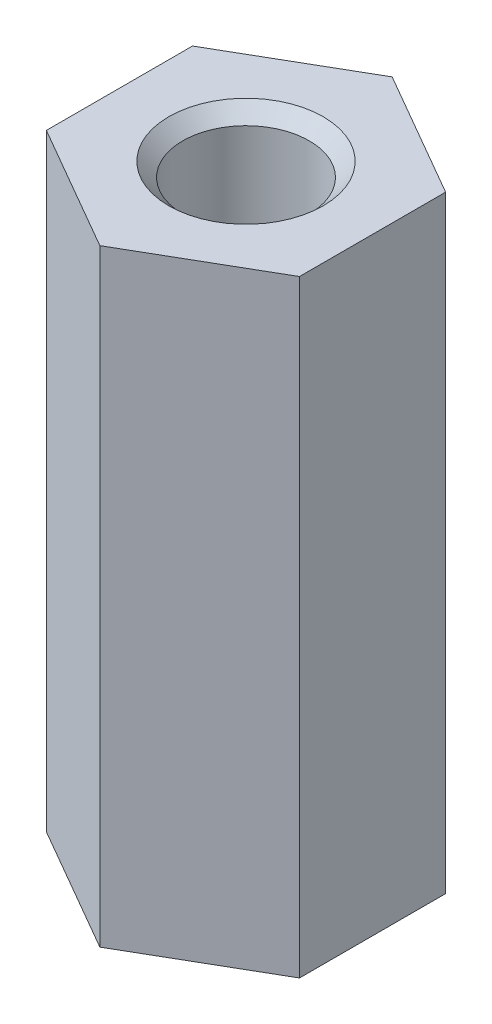
ISO-10303-21;
HEADER;
FILE_DESCRIPTION(('STEP AP214'),'2;1');
FILE_NAME('part.step','',(''),(''),'','','');
FILE_SCHEMA(('AUTOMOTIVE_DESIGN { 1 0 10303 214 1 1 1 1 }'));
ENDSEC;
DATA;
#1=APPLICATION_CONTEXT('core data for automotive mechanical design processes');
#2=APPLICATION_PROTOCOL_DEFINITION('international standard','automotive_design',2000,#1);
#3=PRODUCT_CONTEXT('',#1,'mechanical');
#4=PRODUCT('Part','Part','',(#3));
#5=PRODUCT_RELATED_PRODUCT_CATEGORY('part','',(#4));
#6=PRODUCT_DEFINITION_FORMATION('','',#4);
#7=PRODUCT_DEFINITION_CONTEXT('part definition',#1,'design');
#8=PRODUCT_DEFINITION('design','',#6,#7);
#9=PRODUCT_DEFINITION_SHAPE('','',#8);
#10=(LENGTH_UNIT() NAMED_UNIT(*) SI_UNIT(.MILLI.,.METRE.));
#11=(NAMED_UNIT(*) PLANE_ANGLE_UNIT() SI_UNIT($,.RADIAN.));
#12=(NAMED_UNIT(*) SI_UNIT($,.STERADIAN.) SOLID_ANGLE_UNIT());
#13=UNCERTAINTY_MEASURE_WITH_UNIT(LENGTH_MEASURE(1.E-05),#10,'distance_accuracy_value','');
#14=(GEOMETRIC_REPRESENTATION_CONTEXT(3) GLOBAL_UNCERTAINTY_ASSIGNED_CONTEXT((#13)) GLOBAL_UNIT_ASSIGNED_CONTEXT((#10,
#11,#12)) REPRESENTATION_CONTEXT('',''));
#15=CARTESIAN_POINT('',(0.,0.,0.));
#16=DIRECTION('',(0.,0.,1.));
#17=DIRECTION('',(1.,0.,0.));
#18=AXIS2_PLACEMENT_3D('',#15,#16,#17);
#19=CARTESIAN_POINT('',(0.,12.,-2.88675134594813));
#20=DIRECTION('',(0.5,0.,0.866025403784439));
#21=DIRECTION('',(0.866025403784439,0.,-0.5));
#22=AXIS2_PLACEMENT_3D('',#19,#20,#21);
#23=PLANE('',#22);
#24=DIRECTION('',(-0.866025403784439,0.,0.5));
#25=VECTOR('',#24,1.);
#26=CARTESIAN_POINT('',(0.,0.,-2.88675134594813));
#27=LINE('',#26,#25);
#28=CARTESIAN_POINT('',(0.,0.,-2.88675134594813));
#29=VERTEX_POINT('',#28);
#30=CARTESIAN_POINT('',(-2.5,0.,-1.44337567297407));
#31=VERTEX_POINT('',#30);
#32=EDGE_CURVE('E134',#29,#31,#27,.T.);
#33=ORIENTED_EDGE('',*,*,#32,.T.);
#34=DIRECTION('',(0.,-1.,0.));
#35=VECTOR('',#34,1.);
#36=CARTESIAN_POINT('',(-2.5,12.,-1.44337567297407));
#37=LINE('',#36,#35);
#38=CARTESIAN_POINT('',(-2.5,12.,-1.44337567297407));
#39=VERTEX_POINT('',#38);
#40=EDGE_CURVE('E11',#39,#31,#37,.T.);
#41=ORIENTED_EDGE('',*,*,#40,.F.);
#42=DIRECTION('',(-0.866025403784439,0.,0.5));
#43=VECTOR('',#42,1.);
#44=CARTESIAN_POINT('',(0.,12.,-2.88675134594813));
#45=LINE('',#44,#43);
#46=CARTESIAN_POINT('',(0.,12.,-2.88675134594813));
#47=VERTEX_POINT('',#46);
#48=EDGE_CURVE('E151',#47,#39,#45,.T.);
#49=ORIENTED_EDGE('',*,*,#48,.F.);
#50=DIRECTION('',(0.,-1.,0.));
#51=VECTOR('',#50,1.);
#52=CARTESIAN_POINT('',(0.,12.,-2.88675134594813));
#53=LINE('',#52,#51);
#54=EDGE_CURVE('E130',#47,#29,#53,.T.);
#55=ORIENTED_EDGE('',*,*,#54,.T.);
#56=EDGE_LOOP('',(#33,#41,#49,#55));
#57=FACE_BOUND('',#56,.T.);
#58=ADVANCED_FACE('F45',(#57),#23,.F.);
#59=CARTESIAN_POINT('',(-2.5,12.,-1.44337567297407));
#60=DIRECTION('',(1.,0.,0.));
#61=DIRECTION('',(0.,0.,-1.));
#62=AXIS2_PLACEMENT_3D('',#59,#60,#61);
#63=PLANE('',#62);
#64=DIRECTION('',(0.,0.,1.));
#65=VECTOR('',#64,1.);
#66=CARTESIAN_POINT('',(-2.5,0.,-1.44337567297407));
#67=LINE('',#66,#65);
#68=CARTESIAN_POINT('',(-2.5,0.,1.44337567297406));
#69=VERTEX_POINT('',#68);
#70=EDGE_CURVE('E138',#31,#69,#67,.T.);
#71=ORIENTED_EDGE('',*,*,#70,.T.);
#72=DIRECTION('',(0.,-1.,0.));
#73=VECTOR('',#72,1.);
#74=CARTESIAN_POINT('',(-2.5,12.,1.44337567297406));
#75=LINE('',#74,#73);
#76=CARTESIAN_POINT('',(-2.5,12.,1.44337567297406));
#77=VERTEX_POINT('',#76);
#78=EDGE_CURVE('E54',#77,#69,#75,.T.);
#79=ORIENTED_EDGE('',*,*,#78,.F.);
#80=DIRECTION('',(0.,0.,1.));
#81=VECTOR('',#80,1.);
#82=CARTESIAN_POINT('',(-2.5,12.,-1.44337567297407));
#83=LINE('',#82,#81);
#84=EDGE_CURVE('E99',#39,#77,#83,.T.);
#85=ORIENTED_EDGE('',*,*,#84,.F.);
#86=ORIENTED_EDGE('',*,*,#40,.T.);
#87=EDGE_LOOP('',(#71,#79,#85,#86));
#88=FACE_BOUND('',#87,.T.);
#89=ADVANCED_FACE('F180',(#88),#63,.F.);
#90=CARTESIAN_POINT('',(-2.5,12.,1.44337567297406));
#91=DIRECTION('',(0.5,0.,-0.866025403784439));
#92=DIRECTION('',(-0.866025403784439,0.,-0.5));
#93=AXIS2_PLACEMENT_3D('',#90,#91,#92);
#94=PLANE('',#93);
#95=DIRECTION('',(0.866025403784438,0.,0.5));
#96=VECTOR('',#95,1.);
#97=CARTESIAN_POINT('',(-2.5,0.,1.44337567297406));
#98=LINE('',#97,#96);
#99=CARTESIAN_POINT('',(0.,0.,2.88675134594813));
#100=VERTEX_POINT('',#99);
#101=EDGE_CURVE('E142',#69,#100,#98,.T.);
#102=ORIENTED_EDGE('',*,*,#101,.T.);
#103=DIRECTION('',(0.,-1.,0.));
#104=VECTOR('',#103,1.);
#105=CARTESIAN_POINT('',(0.,12.,2.88675134594813));
#106=LINE('',#105,#104);
#107=CARTESIAN_POINT('',(0.,12.,2.88675134594813));
#108=VERTEX_POINT('',#107);
#109=EDGE_CURVE('E123',#108,#100,#106,.T.);
#110=ORIENTED_EDGE('',*,*,#109,.F.);
#111=DIRECTION('',(0.866025403784438,0.,0.5));
#112=VECTOR('',#111,1.);
#113=CARTESIAN_POINT('',(-2.5,12.,1.44337567297406));
#114=LINE('',#113,#112);
#115=EDGE_CURVE('E112',#77,#108,#114,.T.);
#116=ORIENTED_EDGE('',*,*,#115,.F.);
#117=ORIENTED_EDGE('',*,*,#78,.T.);
#118=EDGE_LOOP('',(#102,#110,#116,#117));
#119=FACE_BOUND('',#118,.T.);
#120=ADVANCED_FACE('F161',(#119),#94,.F.);
#121=CARTESIAN_POINT('',(0.,12.,2.88675134594813));
#122=DIRECTION('',(-0.5,0.,-0.866025403784439));
#123=DIRECTION('',(-0.866025403784439,0.,0.5));
#124=AXIS2_PLACEMENT_3D('',#121,#122,#123);
#125=PLANE('',#124);
#126=DIRECTION('',(0.866025403784438,0.,-0.5));
#127=VECTOR('',#126,1.);
#128=CARTESIAN_POINT('',(0.,0.,2.88675134594813));
#129=LINE('',#128,#127);
#130=CARTESIAN_POINT('',(2.5,0.,1.44337567297406));
#131=VERTEX_POINT('',#130);
#132=EDGE_CURVE('E121',#100,#131,#129,.T.);
#133=ORIENTED_EDGE('',*,*,#132,.T.);
#134=DIRECTION('',(0.,-1.,0.));
#135=VECTOR('',#134,1.);
#136=CARTESIAN_POINT('',(2.5,12.,1.44337567297406));
#137=LINE('',#136,#135);
#138=CARTESIAN_POINT('',(2.5,12.,1.44337567297406));
#139=VERTEX_POINT('',#138);
#140=EDGE_CURVE('E118',#139,#131,#137,.T.);
#141=ORIENTED_EDGE('',*,*,#140,.F.);
#142=DIRECTION('',(0.866025403784438,0.,-0.5));
#143=VECTOR('',#142,1.);
#144=CARTESIAN_POINT('',(0.,12.,2.88675134594813));
#145=LINE('',#144,#143);
#146=EDGE_CURVE('E106',#108,#139,#145,.T.);
#147=ORIENTED_EDGE('',*,*,#146,.F.);
#148=ORIENTED_EDGE('',*,*,#109,.T.);
#149=EDGE_LOOP('',(#133,#141,#147,#148));
#150=FACE_BOUND('',#149,.T.);
#151=ADVANCED_FACE('F119',(#150),#125,.F.);
#152=CARTESIAN_POINT('',(2.5,12.,1.44337567297406));
#153=DIRECTION('',(-1.,0.,0.));
#154=DIRECTION('',(0.,0.,1.));
#155=AXIS2_PLACEMENT_3D('',#152,#153,#154);
#156=PLANE('',#155);
#157=DIRECTION('',(0.,0.,-1.));
#158=VECTOR('',#157,1.);
#159=CARTESIAN_POINT('',(2.5,0.,1.44337567297406));
#160=LINE('',#159,#158);
#161=CARTESIAN_POINT('',(2.5,0.,-1.44337567297407));
#162=VERTEX_POINT('',#161);
#163=EDGE_CURVE('E85',#131,#162,#160,.T.);
#164=ORIENTED_EDGE('',*,*,#163,.T.);
#165=DIRECTION('',(0.,-1.,0.));
#166=VECTOR('',#165,1.);
#167=CARTESIAN_POINT('',(2.5,12.,-1.44337567297407));
#168=LINE('',#167,#166);
#169=CARTESIAN_POINT('',(2.5,12.,-1.44337567297407));
#170=VERTEX_POINT('',#169);
#171=EDGE_CURVE('E124',#170,#162,#168,.T.);
#172=ORIENTED_EDGE('',*,*,#171,.F.);
#173=DIRECTION('',(0.,0.,-1.));
#174=VECTOR('',#173,1.);
#175=CARTESIAN_POINT('',(2.5,12.,1.44337567297406));
#176=LINE('',#175,#174);
#177=EDGE_CURVE('E110',#139,#170,#176,.T.);
#178=ORIENTED_EDGE('',*,*,#177,.F.);
#179=ORIENTED_EDGE('',*,*,#140,.T.);
#180=EDGE_LOOP('',(#164,#172,#178,#179));
#181=FACE_BOUND('',#180,.T.);
#182=ADVANCED_FACE('F126',(#181),#156,.F.);
#183=CARTESIAN_POINT('',(2.5,12.,-1.44337567297407));
#184=DIRECTION('',(-0.5,0.,0.866025403784438));
#185=DIRECTION('',(0.866025403784439,0.,0.5));
#186=AXIS2_PLACEMENT_3D('',#183,#184,#185);
#187=PLANE('',#186);
#188=DIRECTION('',(-0.866025403784439,0.,-0.5));
#189=VECTOR('',#188,1.);
#190=CARTESIAN_POINT('',(2.5,0.,-1.44337567297407));
#191=LINE('',#190,#189);
#192=EDGE_CURVE('E91',#162,#29,#191,.T.);
#193=ORIENTED_EDGE('',*,*,#192,.T.);
#194=ORIENTED_EDGE('',*,*,#54,.F.);
#195=DIRECTION('',(-0.866025403784439,0.,-0.5));
#196=VECTOR('',#195,1.);
#197=CARTESIAN_POINT('',(2.5,12.,-1.44337567297407));
#198=LINE('',#197,#196);
#199=EDGE_CURVE('E62',#170,#47,#198,.T.);
#200=ORIENTED_EDGE('',*,*,#199,.F.);
#201=ORIENTED_EDGE('',*,*,#171,.T.);
#202=EDGE_LOOP('',(#193,#194,#200,#201));
#203=FACE_BOUND('',#202,.T.);
#204=ADVANCED_FACE('F168',(#203),#187,.F.);
#205=CARTESIAN_POINT('',(0.,12.,0.));
#206=DIRECTION('',(0.,1.,0.));
#207=DIRECTION('',(0.,0.,1.));
#208=AXIS2_PLACEMENT_3D('',#205,#206,#207);
#209=PLANE('',#208);
#210=CARTESIAN_POINT('',(0.,12.,0.));
#211=DIRECTION('',(0.,1.,0.));
#212=DIRECTION('',(0.,0.,1.));
#213=AXIS2_PLACEMENT_3D('',#210,#211,#212);
#214=CIRCLE('',#213,1.525);
#215=CARTESIAN_POINT('',(0.,12.,1.525));
#216=VERTEX_POINT('',#215);
#217=EDGE_CURVE('E277',#216,#216,#214,.T.);
#218=ORIENTED_EDGE('',*,*,#217,.F.);
#219=EDGE_LOOP('',(#218));
#220=FACE_BOUND('',#219,.T.);
#221=ORIENTED_EDGE('',*,*,#48,.T.);
#222=ORIENTED_EDGE('',*,*,#84,.T.);
#223=ORIENTED_EDGE('',*,*,#115,.T.);
#224=ORIENTED_EDGE('',*,*,#146,.T.);
#225=ORIENTED_EDGE('',*,*,#177,.T.);
#226=ORIENTED_EDGE('',*,*,#199,.T.);
#227=EDGE_LOOP('',(#221,#222,#223,#224,#225,#226));
#228=FACE_BOUND('',#227,.T.);
#229=ADVANCED_FACE('F108',(#220,#228),#209,.T.);
#230=CARTESIAN_POINT('',(0.,0.,0.));
#231=DIRECTION('',(0.,1.,0.));
#232=DIRECTION('',(0.,0.,1.));
#233=AXIS2_PLACEMENT_3D('',#230,#231,#232);
#234=PLANE('',#233);
#235=CARTESIAN_POINT('',(0.,0.,0.));
#236=DIRECTION('',(0.,-1.,0.));
#237=DIRECTION('',(0.,0.,-1.));
#238=AXIS2_PLACEMENT_3D('',#235,#236,#237);
#239=CIRCLE('',#238,1.525);
#240=CARTESIAN_POINT('',(0.,0.,-1.525));
#241=VERTEX_POINT('',#240);
#242=EDGE_CURVE('E273',#241,#241,#239,.T.);
#243=ORIENTED_EDGE('',*,*,#242,.F.);
#244=EDGE_LOOP('',(#243));
#245=FACE_BOUND('',#244,.T.);
#246=ORIENTED_EDGE('',*,*,#32,.F.);
#247=ORIENTED_EDGE('',*,*,#192,.F.);
#248=ORIENTED_EDGE('',*,*,#163,.F.);
#249=ORIENTED_EDGE('',*,*,#132,.F.);
#250=ORIENTED_EDGE('',*,*,#101,.F.);
#251=ORIENTED_EDGE('',*,*,#70,.F.);
#252=EDGE_LOOP('',(#246,#247,#248,#249,#250,#251));
#253=FACE_BOUND('',#252,.T.);
#254=ADVANCED_FACE('F164',(#245,#253),#234,.F.);
#255=CARTESIAN_POINT('',(0.,12.,0.));
#256=DIRECTION('',(0.,1.,0.));
#257=DIRECTION('',(0.,0.,1.));
#258=AXIS2_PLACEMENT_3D('',#255,#256,#257);
#259=CYLINDRICAL_SURFACE('',#258,1.25);
#260=CARTESIAN_POINT('',(0.,11.725,0.));
#261=DIRECTION('',(0.,1.,0.));
#262=DIRECTION('',(0.,0.,1.));
#263=AXIS2_PLACEMENT_3D('',#260,#261,#262);
#264=CIRCLE('',#263,1.25);
#265=CARTESIAN_POINT('',(0.,11.725,1.25));
#266=VERTEX_POINT('',#265);
#267=EDGE_CURVE('E139',#266,#266,#264,.T.);
#268=ORIENTED_EDGE('',*,*,#267,.T.);
#269=EDGE_LOOP('',(#268));
#270=FACE_BOUND('',#269,.T.);
#271=CARTESIAN_POINT('',(0.,0.274999999999997,0.));
#272=DIRECTION('',(0.,-1.,0.));
#273=DIRECTION('',(0.,0.,-1.));
#274=AXIS2_PLACEMENT_3D('',#271,#272,#273);
#275=CIRCLE('',#274,1.24999999999999);
#276=CARTESIAN_POINT('',(0.,0.274999999999997,-1.24999999999999));
#277=VERTEX_POINT('',#276);
#278=EDGE_CURVE('E270',#277,#277,#275,.T.);
#279=ORIENTED_EDGE('',*,*,#278,.T.);
#280=EDGE_LOOP('',(#279));
#281=FACE_BOUND('',#280,.T.);
#282=ADVANCED_FACE('F223',(#270,#281),#259,.F.);
#283=CARTESIAN_POINT('',(0.,12.,0.));
#284=DIRECTION('',(0.,1.,0.));
#285=DIRECTION('',(0.,0.,1.));
#286=AXIS2_PLACEMENT_3D('',#283,#284,#285);
#287=CONICAL_SURFACE('',#286,1.525,0.785398163397448);
#288=ORIENTED_EDGE('',*,*,#267,.F.);
#289=EDGE_LOOP('',(#288));
#290=FACE_BOUND('',#289,.T.);
#291=ORIENTED_EDGE('',*,*,#217,.T.);
#292=EDGE_LOOP('',(#291));
#293=FACE_BOUND('',#292,.T.);
#294=ADVANCED_FACE('F217',(#290,#293),#287,.F.);
#295=CARTESIAN_POINT('',(0.,0.,0.));
#296=DIRECTION('',(0.,-1.,0.));
#297=DIRECTION('',(0.,0.,-1.));
#298=AXIS2_PLACEMENT_3D('',#295,#296,#297);
#299=CONICAL_SURFACE('',#298,1.525,0.78539816339747);
#300=ORIENTED_EDGE('',*,*,#278,.F.);
#301=EDGE_LOOP('',(#300));
#302=FACE_BOUND('',#301,.T.);
#303=ORIENTED_EDGE('',*,*,#242,.T.);
#304=EDGE_LOOP('',(#303));
#305=FACE_BOUND('',#304,.T.);
#306=ADVANCED_FACE('F222',(#302,#305),#299,.F.);
#307=CLOSED_SHELL('',(#58,#89,#120,#151,#182,#204,#229,#254,#282,#294,#306));
#308=MANIFOLD_SOLID_BREP('B2',#307);
#309=ADVANCED_BREP_SHAPE_REPRESENTATION('',(#18,#308),#14);
#310=SHAPE_DEFINITION_REPRESENTATION(#9,#309);
ENDSEC;
END-ISO-10303-21;
